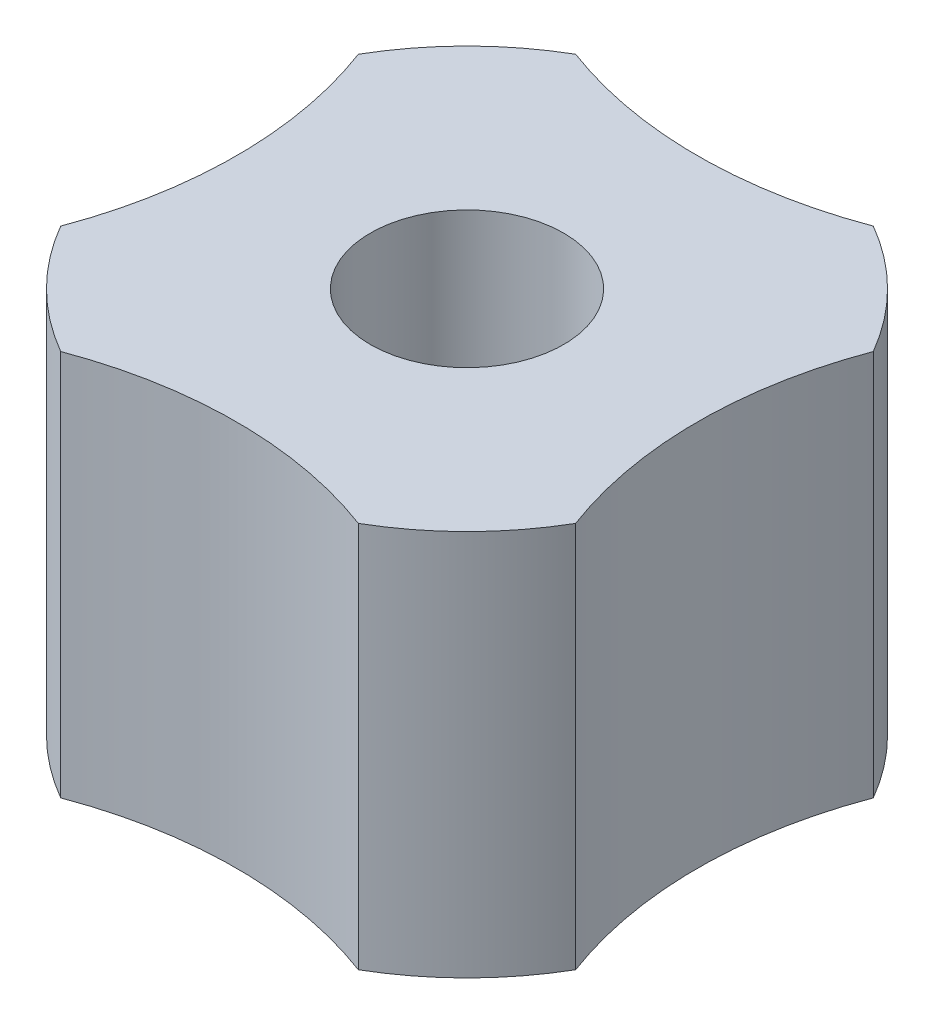
ISO-10303-21;
HEADER;
FILE_DESCRIPTION(('STEP AP214'),'2;1');
FILE_NAME('part.step','',(''),(''),'','','');
FILE_SCHEMA(('AUTOMOTIVE_DESIGN { 1 0 10303 214 1 1 1 1 }'));
ENDSEC;
DATA;
#1=APPLICATION_CONTEXT('core data for automotive mechanical design processes');
#2=APPLICATION_PROTOCOL_DEFINITION('international standard','automotive_design',2000,#1);
#3=PRODUCT_CONTEXT('',#1,'mechanical');
#4=PRODUCT('Part','Part','',(#3));
#5=PRODUCT_RELATED_PRODUCT_CATEGORY('part','',(#4));
#6=PRODUCT_DEFINITION_FORMATION('','',#4);
#7=PRODUCT_DEFINITION_CONTEXT('part definition',#1,'design');
#8=PRODUCT_DEFINITION('design','',#6,#7);
#9=PRODUCT_DEFINITION_SHAPE('','',#8);
#10=(LENGTH_UNIT() NAMED_UNIT(*) SI_UNIT(.MILLI.,.METRE.));
#11=(NAMED_UNIT(*) PLANE_ANGLE_UNIT() SI_UNIT($,.RADIAN.));
#12=(NAMED_UNIT(*) SI_UNIT($,.STERADIAN.) SOLID_ANGLE_UNIT());
#13=UNCERTAINTY_MEASURE_WITH_UNIT(LENGTH_MEASURE(1.E-05),#10,'distance_accuracy_value','');
#14=(GEOMETRIC_REPRESENTATION_CONTEXT(3) GLOBAL_UNCERTAINTY_ASSIGNED_CONTEXT((#13)) GLOBAL_UNIT_ASSIGNED_CONTEXT((#10,
#11,#12)) REPRESENTATION_CONTEXT('',''));
#15=CARTESIAN_POINT('',(0.,0.,0.));
#16=DIRECTION('',(0.,0.,1.));
#17=DIRECTION('',(1.,0.,0.));
#18=AXIS2_PLACEMENT_3D('',#15,#16,#17);
#19=CARTESIAN_POINT('',(2.5,27.,-3.25));
#20=DIRECTION('',(0.,1.,0.));
#21=DIRECTION('',(0.,0.,1.));
#22=AXIS2_PLACEMENT_3D('',#19,#20,#21);
#23=CYLINDRICAL_SURFACE('',#22,2.5);
#24=DIRECTION('',(0.,1.,0.));
#25=VECTOR('',#24,1.);
#26=CARTESIAN_POINT('',(2.5,27.,-5.75));
#27=LINE('',#26,#25);
#28=CARTESIAN_POINT('',(2.5,34.,-5.75));
#29=VERTEX_POINT('',#28);
#30=CARTESIAN_POINT('',(2.5,27.,-5.75));
#31=VERTEX_POINT('',#30);
#32=EDGE_CURVE('E138',#29,#31,#27,.F.);
#33=ORIENTED_EDGE('',*,*,#32,.T.);
#34=CARTESIAN_POINT('',(2.5,27.,-3.25));
#35=DIRECTION('',(0.,1.,0.));
#36=DIRECTION('',(0.,0.,1.));
#37=AXIS2_PLACEMENT_3D('',#34,#35,#36);
#38=CIRCLE('',#37,2.5);
#39=CARTESIAN_POINT('',(5.,27.,-3.25));
#40=VERTEX_POINT('',#39);
#41=EDGE_CURVE('E239',#31,#40,#38,.F.);
#42=ORIENTED_EDGE('',*,*,#41,.T.);
#43=DIRECTION('',(0.,1.,0.));
#44=VECTOR('',#43,1.);
#45=CARTESIAN_POINT('',(5.,27.,-3.25));
#46=LINE('',#45,#44);
#47=CARTESIAN_POINT('',(5.,34.,-3.25));
#48=VERTEX_POINT('',#47);
#49=EDGE_CURVE('E167',#40,#48,#46,.T.);
#50=ORIENTED_EDGE('',*,*,#49,.T.);
#51=CARTESIAN_POINT('',(2.5,34.,-3.25));
#52=DIRECTION('',(0.,1.,0.));
#53=DIRECTION('',(0.,0.,1.));
#54=AXIS2_PLACEMENT_3D('',#51,#52,#53);
#55=CIRCLE('',#54,2.5);
#56=EDGE_CURVE('E232',#29,#48,#55,.F.);
#57=ORIENTED_EDGE('',*,*,#56,.F.);
#58=EDGE_LOOP('',(#33,#42,#50,#57));
#59=FACE_BOUND('',#58,.T.);
#60=ADVANCED_FACE('F16',(#59),#23,.F.);
#61=CARTESIAN_POINT('',(5.,27.,5.75));
#62=DIRECTION('',(1.,0.,0.));
#63=DIRECTION('',(0.,0.,-1.));
#64=AXIS2_PLACEMENT_3D('',#61,#62,#63);
#65=PLANE('',#64);
#66=DIRECTION('',(0.,0.,1.));
#67=VECTOR('',#66,1.);
#68=CARTESIAN_POINT('',(5.,27.,0.));
#69=LINE('',#68,#67);
#70=CARTESIAN_POINT('',(5.,27.,3.25));
#71=VERTEX_POINT('',#70);
#72=EDGE_CURVE('E238',#40,#71,#69,.T.);
#73=ORIENTED_EDGE('',*,*,#72,.T.);
#74=DIRECTION('',(0.,1.,0.));
#75=VECTOR('',#74,1.);
#76=CARTESIAN_POINT('',(5.,27.,3.25));
#77=LINE('',#76,#75);
#78=CARTESIAN_POINT('',(5.,34.,3.25));
#79=VERTEX_POINT('',#78);
#80=EDGE_CURVE('E165',#71,#79,#77,.T.);
#81=ORIENTED_EDGE('',*,*,#80,.T.);
#82=DIRECTION('',(0.,0.,-1.));
#83=VECTOR('',#82,1.);
#84=CARTESIAN_POINT('',(5.,34.,0.));
#85=LINE('',#84,#83);
#86=EDGE_CURVE('E231',#48,#79,#85,.F.);
#87=ORIENTED_EDGE('',*,*,#86,.F.);
#88=ORIENTED_EDGE('',*,*,#49,.F.);
#89=EDGE_LOOP('',(#73,#81,#87,#88));
#90=FACE_BOUND('',#89,.T.);
#91=ADVANCED_FACE('F253',(#90),#65,.F.);
#92=CARTESIAN_POINT('',(2.5,27.,3.25));
#93=DIRECTION('',(0.,1.,0.));
#94=DIRECTION('',(0.,0.,1.));
#95=AXIS2_PLACEMENT_3D('',#92,#93,#94);
#96=CYLINDRICAL_SURFACE('',#95,2.5);
#97=ORIENTED_EDGE('',*,*,#80,.F.);
#98=CARTESIAN_POINT('',(2.5,27.,3.25));
#99=DIRECTION('',(0.,1.,0.));
#100=DIRECTION('',(0.,0.,1.));
#101=AXIS2_PLACEMENT_3D('',#98,#99,#100);
#102=CIRCLE('',#101,2.5);
#103=CARTESIAN_POINT('',(2.5,27.,5.75));
#104=VERTEX_POINT('',#103);
#105=EDGE_CURVE('E236',#71,#104,#102,.F.);
#106=ORIENTED_EDGE('',*,*,#105,.T.);
#107=DIRECTION('',(0.,1.,0.));
#108=VECTOR('',#107,1.);
#109=CARTESIAN_POINT('',(2.5,27.,5.75));
#110=LINE('',#109,#108);
#111=CARTESIAN_POINT('',(2.5,34.,5.75));
#112=VERTEX_POINT('',#111);
#113=EDGE_CURVE('E163',#104,#112,#110,.T.);
#114=ORIENTED_EDGE('',*,*,#113,.T.);
#115=CARTESIAN_POINT('',(2.5,34.,3.25));
#116=DIRECTION('',(0.,1.,0.));
#117=DIRECTION('',(0.,0.,1.));
#118=AXIS2_PLACEMENT_3D('',#115,#116,#117);
#119=CIRCLE('',#118,2.5);
#120=EDGE_CURVE('E228',#79,#112,#119,.F.);
#121=ORIENTED_EDGE('',*,*,#120,.F.);
#122=EDGE_LOOP('',(#97,#106,#114,#121));
#123=FACE_BOUND('',#122,.T.);
#124=ADVANCED_FACE('F257',(#123),#96,.F.);
#125=CARTESIAN_POINT('',(-5.,27.,5.75));
#126=DIRECTION('',(0.,0.,1.));
#127=DIRECTION('',(1.,0.,0.));
#128=AXIS2_PLACEMENT_3D('',#125,#126,#127);
#129=PLANE('',#128);
#130=DIRECTION('',(1.,0.,0.));
#131=VECTOR('',#130,1.);
#132=CARTESIAN_POINT('',(0.,34.,5.75));
#133=LINE('',#132,#131);
#134=CARTESIAN_POINT('',(-2.5,34.,5.75));
#135=VERTEX_POINT('',#134);
#136=EDGE_CURVE('E227',#112,#135,#133,.F.);
#137=ORIENTED_EDGE('',*,*,#136,.F.);
#138=ORIENTED_EDGE('',*,*,#113,.F.);
#139=DIRECTION('',(1.,0.,0.));
#140=VECTOR('',#139,1.);
#141=CARTESIAN_POINT('',(0.,27.,5.75));
#142=LINE('',#141,#140);
#143=CARTESIAN_POINT('',(-2.5,27.,5.75));
#144=VERTEX_POINT('',#143);
#145=EDGE_CURVE('E235',#104,#144,#142,.F.);
#146=ORIENTED_EDGE('',*,*,#145,.T.);
#147=DIRECTION('',(0.,1.,0.));
#148=VECTOR('',#147,1.);
#149=CARTESIAN_POINT('',(-2.5,27.,5.75));
#150=LINE('',#149,#148);
#151=EDGE_CURVE('E127',#144,#135,#150,.T.);
#152=ORIENTED_EDGE('',*,*,#151,.T.);
#153=EDGE_LOOP('',(#137,#138,#146,#152));
#154=FACE_BOUND('',#153,.T.);
#155=ADVANCED_FACE('F269',(#154),#129,.F.);
#156=CARTESIAN_POINT('',(-2.5,27.,3.25));
#157=DIRECTION('',(0.,1.,0.));
#158=DIRECTION('',(0.,0.,1.));
#159=AXIS2_PLACEMENT_3D('',#156,#157,#158);
#160=CYLINDRICAL_SURFACE('',#159,2.5);
#161=ORIENTED_EDGE('',*,*,#151,.F.);
#162=CARTESIAN_POINT('',(-2.5,27.,3.25));
#163=DIRECTION('',(0.,1.,0.));
#164=DIRECTION('',(0.,0.,1.));
#165=AXIS2_PLACEMENT_3D('',#162,#163,#164);
#166=CIRCLE('',#165,2.5);
#167=CARTESIAN_POINT('',(-5.,27.,3.25));
#168=VERTEX_POINT('',#167);
#169=EDGE_CURVE('E19',#144,#168,#166,.F.);
#170=ORIENTED_EDGE('',*,*,#169,.T.);
#171=DIRECTION('',(0.,1.,0.));
#172=VECTOR('',#171,1.);
#173=CARTESIAN_POINT('',(-5.,27.,3.25));
#174=LINE('',#173,#172);
#175=CARTESIAN_POINT('',(-5.,34.,3.25));
#176=VERTEX_POINT('',#175);
#177=EDGE_CURVE('E132',#168,#176,#174,.T.);
#178=ORIENTED_EDGE('',*,*,#177,.T.);
#179=CARTESIAN_POINT('',(-2.5,34.,3.25));
#180=DIRECTION('',(0.,1.,0.));
#181=DIRECTION('',(0.,0.,1.));
#182=AXIS2_PLACEMENT_3D('',#179,#180,#181);
#183=CIRCLE('',#182,2.5);
#184=EDGE_CURVE('E225',#135,#176,#183,.F.);
#185=ORIENTED_EDGE('',*,*,#184,.F.);
#186=EDGE_LOOP('',(#161,#170,#178,#185));
#187=FACE_BOUND('',#186,.T.);
#188=ADVANCED_FACE('F131',(#187),#160,.F.);
#189=CARTESIAN_POINT('',(-5.,27.,-5.75));
#190=DIRECTION('',(-1.,0.,0.));
#191=DIRECTION('',(0.,0.,1.));
#192=AXIS2_PLACEMENT_3D('',#189,#190,#191);
#193=PLANE('',#192);
#194=DIRECTION('',(0.,0.,-1.));
#195=VECTOR('',#194,1.);
#196=CARTESIAN_POINT('',(-5.,34.,0.));
#197=LINE('',#196,#195);
#198=CARTESIAN_POINT('',(-5.,34.,-3.25));
#199=VERTEX_POINT('',#198);
#200=EDGE_CURVE('E143',#176,#199,#197,.T.);
#201=ORIENTED_EDGE('',*,*,#200,.F.);
#202=ORIENTED_EDGE('',*,*,#177,.F.);
#203=DIRECTION('',(0.,0.,1.));
#204=VECTOR('',#203,1.);
#205=CARTESIAN_POINT('',(-5.,27.,0.));
#206=LINE('',#205,#204);
#207=CARTESIAN_POINT('',(-5.,27.,-3.25));
#208=VERTEX_POINT('',#207);
#209=EDGE_CURVE('E137',#168,#208,#206,.F.);
#210=ORIENTED_EDGE('',*,*,#209,.T.);
#211=DIRECTION('',(0.,1.,0.));
#212=VECTOR('',#211,1.);
#213=CARTESIAN_POINT('',(-5.,27.,-3.25));
#214=LINE('',#213,#212);
#215=EDGE_CURVE('E145',#208,#199,#214,.T.);
#216=ORIENTED_EDGE('',*,*,#215,.T.);
#217=EDGE_LOOP('',(#201,#202,#210,#216));
#218=FACE_BOUND('',#217,.T.);
#219=ADVANCED_FACE('F140',(#218),#193,.F.);
#220=CARTESIAN_POINT('',(-2.5,27.,-3.25));
#221=DIRECTION('',(0.,1.,0.));
#222=DIRECTION('',(0.,0.,1.));
#223=AXIS2_PLACEMENT_3D('',#220,#221,#222);
#224=CYLINDRICAL_SURFACE('',#223,2.5);
#225=ORIENTED_EDGE('',*,*,#215,.F.);
#226=CARTESIAN_POINT('',(-2.5,27.,-3.25));
#227=DIRECTION('',(0.,1.,0.));
#228=DIRECTION('',(0.,0.,1.));
#229=AXIS2_PLACEMENT_3D('',#226,#227,#228);
#230=CIRCLE('',#229,2.5);
#231=CARTESIAN_POINT('',(-2.5,27.,-5.75));
#232=VERTEX_POINT('',#231);
#233=EDGE_CURVE('E152',#208,#232,#230,.F.);
#234=ORIENTED_EDGE('',*,*,#233,.T.);
#235=DIRECTION('',(0.,1.,0.));
#236=VECTOR('',#235,1.);
#237=CARTESIAN_POINT('',(-2.5,27.,-5.75));
#238=LINE('',#237,#236);
#239=CARTESIAN_POINT('',(-2.5,34.,-5.75));
#240=VERTEX_POINT('',#239);
#241=EDGE_CURVE('E158',#232,#240,#238,.T.);
#242=ORIENTED_EDGE('',*,*,#241,.T.);
#243=CARTESIAN_POINT('',(-2.5,34.,-3.25));
#244=DIRECTION('',(0.,1.,0.));
#245=DIRECTION('',(0.,0.,1.));
#246=AXIS2_PLACEMENT_3D('',#243,#244,#245);
#247=CIRCLE('',#246,2.5);
#248=EDGE_CURVE('E222',#199,#240,#247,.F.);
#249=ORIENTED_EDGE('',*,*,#248,.F.);
#250=EDGE_LOOP('',(#225,#234,#242,#249));
#251=FACE_BOUND('',#250,.T.);
#252=ADVANCED_FACE('F348',(#251),#224,.F.);
#253=CARTESIAN_POINT('',(5.,27.,-5.75));
#254=DIRECTION('',(0.,0.,-1.));
#255=DIRECTION('',(-1.,0.,0.));
#256=AXIS2_PLACEMENT_3D('',#253,#254,#255);
#257=PLANE('',#256);
#258=DIRECTION('',(1.,0.,0.));
#259=VECTOR('',#258,1.);
#260=CARTESIAN_POINT('',(0.,34.,-5.75));
#261=LINE('',#260,#259);
#262=EDGE_CURVE('E221',#240,#29,#261,.T.);
#263=ORIENTED_EDGE('',*,*,#262,.F.);
#264=ORIENTED_EDGE('',*,*,#241,.F.);
#265=DIRECTION('',(1.,0.,0.));
#266=VECTOR('',#265,1.);
#267=CARTESIAN_POINT('',(0.,27.,-5.75));
#268=LINE('',#267,#266);
#269=EDGE_CURVE('E154',#232,#31,#268,.T.);
#270=ORIENTED_EDGE('',*,*,#269,.T.);
#271=ORIENTED_EDGE('',*,*,#32,.F.);
#272=EDGE_LOOP('',(#263,#264,#270,#271));
#273=FACE_BOUND('',#272,.T.);
#274=ADVANCED_FACE('F248',(#273),#257,.F.);
#275=CARTESIAN_POINT('',(0.,27.,0.));
#276=DIRECTION('',(0.,1.,0.));
#277=DIRECTION('',(0.,0.,1.));
#278=AXIS2_PLACEMENT_3D('',#275,#276,#277);
#279=PLANE('',#278);
#280=ORIENTED_EDGE('',*,*,#105,.F.);
#281=ORIENTED_EDGE('',*,*,#72,.F.);
#282=ORIENTED_EDGE('',*,*,#41,.F.);
#283=ORIENTED_EDGE('',*,*,#269,.F.);
#284=ORIENTED_EDGE('',*,*,#233,.F.);
#285=ORIENTED_EDGE('',*,*,#209,.F.);
#286=ORIENTED_EDGE('',*,*,#169,.F.);
#287=ORIENTED_EDGE('',*,*,#145,.F.);
#288=EDGE_LOOP('',(#280,#281,#282,#283,#284,#285,#286,#287));
#289=FACE_BOUND('',#288,.T.);
#290=CARTESIAN_POINT('',(0.,27.,-22.));
#291=DIRECTION('',(0.,-1.,0.));
#292=DIRECTION('',(0.,0.,-1.));
#293=AXIS2_PLACEMENT_3D('',#290,#291,#292);
#294=CIRCLE('',#293,14.25);
#295=CARTESIAN_POINT('',(-5.00447222996498,27.,-8.65767045454545));
#296=VERTEX_POINT('',#295);
#297=CARTESIAN_POINT('',(5.00447222996498,27.,-8.65767045454545));
#298=VERTEX_POINT('',#297);
#299=EDGE_CURVE('E195',#296,#298,#294,.F.);
#300=ORIENTED_EDGE('',*,*,#299,.T.);
#301=CARTESIAN_POINT('',(0.,27.,0.));
#302=DIRECTION('',(0.,-1.,0.));
#303=DIRECTION('',(0.,0.,-1.));
#304=AXIS2_PLACEMENT_3D('',#301,#302,#303);
#305=CIRCLE('',#304,10.);
#306=CARTESIAN_POINT('',(8.65767045454546,27.,-5.00447222996498));
#307=VERTEX_POINT('',#306);
#308=EDGE_CURVE('E198',#307,#298,#305,.F.);
#309=ORIENTED_EDGE('',*,*,#308,.F.);
#310=CARTESIAN_POINT('',(22.,27.,0.));
#311=DIRECTION('',(0.,-1.,0.));
#312=DIRECTION('',(0.,0.,-1.));
#313=AXIS2_PLACEMENT_3D('',#310,#311,#312);
#314=CIRCLE('',#313,14.25);
#315=CARTESIAN_POINT('',(8.65767045454545,27.,5.00447222996499));
#316=VERTEX_POINT('',#315);
#317=EDGE_CURVE('E201',#307,#316,#314,.F.);
#318=ORIENTED_EDGE('',*,*,#317,.T.);
#319=CARTESIAN_POINT('',(0.,27.,0.));
#320=DIRECTION('',(0.,-1.,0.));
#321=DIRECTION('',(0.,0.,-1.));
#322=AXIS2_PLACEMENT_3D('',#319,#320,#321);
#323=CIRCLE('',#322,10.);
#324=CARTESIAN_POINT('',(5.00447222996498,27.,8.65767045454546));
#325=VERTEX_POINT('',#324);
#326=EDGE_CURVE('E204',#325,#316,#323,.F.);
#327=ORIENTED_EDGE('',*,*,#326,.F.);
#328=CARTESIAN_POINT('',(0.,27.,22.));
#329=DIRECTION('',(0.,-1.,0.));
#330=DIRECTION('',(0.,0.,-1.));
#331=AXIS2_PLACEMENT_3D('',#328,#329,#330);
#332=CIRCLE('',#331,14.25);
#333=CARTESIAN_POINT('',(-5.00447222996498,27.,8.65767045454545));
#334=VERTEX_POINT('',#333);
#335=EDGE_CURVE('E208',#325,#334,#332,.F.);
#336=ORIENTED_EDGE('',*,*,#335,.T.);
#337=CARTESIAN_POINT('',(0.,27.,0.));
#338=DIRECTION('',(0.,-1.,0.));
#339=DIRECTION('',(0.,0.,-1.));
#340=AXIS2_PLACEMENT_3D('',#337,#338,#339);
#341=CIRCLE('',#340,10.);
#342=CARTESIAN_POINT('',(-8.65767045454545,27.,5.00447222996499));
#343=VERTEX_POINT('',#342);
#344=EDGE_CURVE('E211',#343,#334,#341,.F.);
#345=ORIENTED_EDGE('',*,*,#344,.F.);
#346=CARTESIAN_POINT('',(-22.,27.,0.));
#347=DIRECTION('',(0.,-1.,0.));
#348=DIRECTION('',(0.,0.,-1.));
#349=AXIS2_PLACEMENT_3D('',#346,#347,#348);
#350=CIRCLE('',#349,14.25);
#351=CARTESIAN_POINT('',(-8.65767045454545,27.,-5.00447222996498));
#352=VERTEX_POINT('',#351);
#353=EDGE_CURVE('E215',#343,#352,#350,.F.);
#354=ORIENTED_EDGE('',*,*,#353,.T.);
#355=CARTESIAN_POINT('',(0.,27.,0.));
#356=DIRECTION('',(0.,-1.,0.));
#357=DIRECTION('',(0.,0.,-1.));
#358=AXIS2_PLACEMENT_3D('',#355,#356,#357);
#359=CIRCLE('',#358,10.);
#360=EDGE_CURVE('E218',#296,#352,#359,.F.);
#361=ORIENTED_EDGE('',*,*,#360,.F.);
#362=EDGE_LOOP('',(#300,#309,#318,#327,#336,#345,#354,#361));
#363=FACE_BOUND('',#362,.T.);
#364=ADVANCED_FACE('F149',(#289,#363),#279,.F.);
#365=CARTESIAN_POINT('',(0.,34.,0.));
#366=DIRECTION('',(0.,-1.,0.));
#367=DIRECTION('',(0.,0.,-1.));
#368=AXIS2_PLACEMENT_3D('',#365,#366,#367);
#369=PLANE('',#368);
#370=CARTESIAN_POINT('',(0.,34.,0.));
#371=DIRECTION('',(0.,-1.,0.));
#372=DIRECTION('',(0.,0.,-1.));
#373=AXIS2_PLACEMENT_3D('',#370,#371,#372);
#374=CIRCLE('',#373,3.25);
#375=CARTESIAN_POINT('',(0.,34.,-3.25));
#376=VERTEX_POINT('',#375);
#377=EDGE_CURVE('E192',#376,#376,#374,.F.);
#378=ORIENTED_EDGE('',*,*,#377,.T.);
#379=EDGE_LOOP('',(#378));
#380=FACE_BOUND('',#379,.T.);
#381=ORIENTED_EDGE('',*,*,#248,.T.);
#382=ORIENTED_EDGE('',*,*,#262,.T.);
#383=ORIENTED_EDGE('',*,*,#56,.T.);
#384=ORIENTED_EDGE('',*,*,#86,.T.);
#385=ORIENTED_EDGE('',*,*,#120,.T.);
#386=ORIENTED_EDGE('',*,*,#136,.T.);
#387=ORIENTED_EDGE('',*,*,#184,.T.);
#388=ORIENTED_EDGE('',*,*,#200,.T.);
#389=EDGE_LOOP('',(#381,#382,#383,#384,#385,#386,#387,#388));
#390=FACE_BOUND('',#389,.T.);
#391=ADVANCED_FACE('F263',(#380,#390),#369,.T.);
#392=CARTESIAN_POINT('',(0.,40.,0.));
#393=DIRECTION('',(0.,-1.,0.));
#394=DIRECTION('',(0.,0.,-1.));
#395=AXIS2_PLACEMENT_3D('',#392,#393,#394);
#396=CYLINDRICAL_SURFACE('',#395,10.);
#397=ORIENTED_EDGE('',*,*,#360,.T.);
#398=DIRECTION('',(0.,-1.,0.));
#399=VECTOR('',#398,1.);
#400=CARTESIAN_POINT('',(-8.65767045454545,40.,-5.00447222996498));
#401=LINE('',#400,#399);
#402=CARTESIAN_POINT('',(-8.65767045454545,40.,-5.00447222996498));
#403=VERTEX_POINT('',#402);
#404=EDGE_CURVE('E217',#352,#403,#401,.F.);
#405=ORIENTED_EDGE('',*,*,#404,.T.);
#406=CARTESIAN_POINT('',(0.,40.,0.));
#407=DIRECTION('',(0.,-1.,0.));
#408=DIRECTION('',(0.,0.,-1.));
#409=AXIS2_PLACEMENT_3D('',#406,#407,#408);
#410=CIRCLE('',#409,10.);
#411=CARTESIAN_POINT('',(-5.00447222996498,40.,-8.65767045454545));
#412=VERTEX_POINT('',#411);
#413=EDGE_CURVE('E189',#412,#403,#410,.F.);
#414=ORIENTED_EDGE('',*,*,#413,.F.);
#415=DIRECTION('',(0.,-1.,0.));
#416=VECTOR('',#415,1.);
#417=CARTESIAN_POINT('',(-5.00447222996498,40.,-8.65767045454545));
#418=LINE('',#417,#416);
#419=EDGE_CURVE('E197',#412,#296,#418,.T.);
#420=ORIENTED_EDGE('',*,*,#419,.T.);
#421=EDGE_LOOP('',(#397,#405,#414,#420));
#422=FACE_BOUND('',#421,.T.);
#423=ADVANCED_FACE('F287',(#422),#396,.T.);
#424=CARTESIAN_POINT('',(-22.,40.,0.));
#425=DIRECTION('',(0.,-1.,0.));
#426=DIRECTION('',(0.,0.,-1.));
#427=AXIS2_PLACEMENT_3D('',#424,#425,#426);
#428=CYLINDRICAL_SURFACE('',#427,14.25);
#429=ORIENTED_EDGE('',*,*,#404,.F.);
#430=ORIENTED_EDGE('',*,*,#353,.F.);
#431=DIRECTION('',(0.,-1.,0.));
#432=VECTOR('',#431,1.);
#433=CARTESIAN_POINT('',(-8.65767045454545,40.,5.00447222996499));
#434=LINE('',#433,#432);
#435=CARTESIAN_POINT('',(-8.65767045454545,40.,5.00447222996499));
#436=VERTEX_POINT('',#435);
#437=EDGE_CURVE('E214',#436,#343,#434,.T.);
#438=ORIENTED_EDGE('',*,*,#437,.F.);
#439=CARTESIAN_POINT('',(-22.,40.,0.));
#440=DIRECTION('',(0.,-1.,0.));
#441=DIRECTION('',(0.,0.,-1.));
#442=AXIS2_PLACEMENT_3D('',#439,#440,#441);
#443=CIRCLE('',#442,14.25);
#444=EDGE_CURVE('E186',#403,#436,#443,.T.);
#445=ORIENTED_EDGE('',*,*,#444,.F.);
#446=EDGE_LOOP('',(#429,#430,#438,#445));
#447=FACE_BOUND('',#446,.T.);
#448=ADVANCED_FACE('F311',(#447),#428,.F.);
#449=CARTESIAN_POINT('',(0.,40.,0.));
#450=DIRECTION('',(0.,-1.,0.));
#451=DIRECTION('',(0.,0.,-1.));
#452=AXIS2_PLACEMENT_3D('',#449,#450,#451);
#453=CYLINDRICAL_SURFACE('',#452,10.);
#454=ORIENTED_EDGE('',*,*,#344,.T.);
#455=DIRECTION('',(0.,-1.,0.));
#456=VECTOR('',#455,1.);
#457=CARTESIAN_POINT('',(-5.00447222996498,40.,8.65767045454545));
#458=LINE('',#457,#456);
#459=CARTESIAN_POINT('',(-5.00447222996498,40.,8.65767045454545));
#460=VERTEX_POINT('',#459);
#461=EDGE_CURVE('E210',#334,#460,#458,.F.);
#462=ORIENTED_EDGE('',*,*,#461,.T.);
#463=CARTESIAN_POINT('',(0.,40.,0.));
#464=DIRECTION('',(0.,-1.,0.));
#465=DIRECTION('',(0.,0.,-1.));
#466=AXIS2_PLACEMENT_3D('',#463,#464,#465);
#467=CIRCLE('',#466,10.);
#468=EDGE_CURVE('E183',#436,#460,#467,.F.);
#469=ORIENTED_EDGE('',*,*,#468,.F.);
#470=ORIENTED_EDGE('',*,*,#437,.T.);
#471=EDGE_LOOP('',(#454,#462,#469,#470));
#472=FACE_BOUND('',#471,.T.);
#473=ADVANCED_FACE('F307',(#472),#453,.T.);
#474=CARTESIAN_POINT('',(0.,40.,22.));
#475=DIRECTION('',(0.,-1.,0.));
#476=DIRECTION('',(0.,0.,-1.));
#477=AXIS2_PLACEMENT_3D('',#474,#475,#476);
#478=CYLINDRICAL_SURFACE('',#477,14.25);
#479=ORIENTED_EDGE('',*,*,#461,.F.);
#480=ORIENTED_EDGE('',*,*,#335,.F.);
#481=DIRECTION('',(0.,-1.,0.));
#482=VECTOR('',#481,1.);
#483=CARTESIAN_POINT('',(5.00447222996498,40.,8.65767045454546));
#484=LINE('',#483,#482);
#485=CARTESIAN_POINT('',(5.00447222996498,40.,8.65767045454546));
#486=VERTEX_POINT('',#485);
#487=EDGE_CURVE('E207',#486,#325,#484,.T.);
#488=ORIENTED_EDGE('',*,*,#487,.F.);
#489=CARTESIAN_POINT('',(0.,40.,22.));
#490=DIRECTION('',(0.,-1.,0.));
#491=DIRECTION('',(0.,0.,-1.));
#492=AXIS2_PLACEMENT_3D('',#489,#490,#491);
#493=CIRCLE('',#492,14.25);
#494=EDGE_CURVE('E180',#460,#486,#493,.T.);
#495=ORIENTED_EDGE('',*,*,#494,.F.);
#496=EDGE_LOOP('',(#479,#480,#488,#495));
#497=FACE_BOUND('',#496,.T.);
#498=ADVANCED_FACE('F304',(#497),#478,.F.);
#499=CARTESIAN_POINT('',(0.,40.,0.));
#500=DIRECTION('',(0.,-1.,0.));
#501=DIRECTION('',(0.,0.,-1.));
#502=AXIS2_PLACEMENT_3D('',#499,#500,#501);
#503=CYLINDRICAL_SURFACE('',#502,10.);
#504=ORIENTED_EDGE('',*,*,#326,.T.);
#505=DIRECTION('',(0.,-1.,0.));
#506=VECTOR('',#505,1.);
#507=CARTESIAN_POINT('',(8.65767045454546,40.,5.00447222996499));
#508=LINE('',#507,#506);
#509=CARTESIAN_POINT('',(8.65767045454545,40.,5.00447222996499));
#510=VERTEX_POINT('',#509);
#511=EDGE_CURVE('E203',#316,#510,#508,.F.);
#512=ORIENTED_EDGE('',*,*,#511,.T.);
#513=CARTESIAN_POINT('',(0.,40.,0.));
#514=DIRECTION('',(0.,-1.,0.));
#515=DIRECTION('',(0.,0.,-1.));
#516=AXIS2_PLACEMENT_3D('',#513,#514,#515);
#517=CIRCLE('',#516,10.);
#518=EDGE_CURVE('E177',#486,#510,#517,.F.);
#519=ORIENTED_EDGE('',*,*,#518,.F.);
#520=ORIENTED_EDGE('',*,*,#487,.T.);
#521=EDGE_LOOP('',(#504,#512,#519,#520));
#522=FACE_BOUND('',#521,.T.);
#523=ADVANCED_FACE('F299',(#522),#503,.T.);
#524=CARTESIAN_POINT('',(22.,40.,0.));
#525=DIRECTION('',(0.,-1.,0.));
#526=DIRECTION('',(0.,0.,-1.));
#527=AXIS2_PLACEMENT_3D('',#524,#525,#526);
#528=CYLINDRICAL_SURFACE('',#527,14.25);
#529=ORIENTED_EDGE('',*,*,#511,.F.);
#530=ORIENTED_EDGE('',*,*,#317,.F.);
#531=DIRECTION('',(0.,-1.,0.));
#532=VECTOR('',#531,1.);
#533=CARTESIAN_POINT('',(8.65767045454546,40.,-5.00447222996498));
#534=LINE('',#533,#532);
#535=CARTESIAN_POINT('',(8.65767045454546,40.,-5.00447222996498));
#536=VERTEX_POINT('',#535);
#537=EDGE_CURVE('E200',#536,#307,#534,.T.);
#538=ORIENTED_EDGE('',*,*,#537,.F.);
#539=CARTESIAN_POINT('',(22.,40.,0.));
#540=DIRECTION('',(0.,-1.,0.));
#541=DIRECTION('',(0.,0.,-1.));
#542=AXIS2_PLACEMENT_3D('',#539,#540,#541);
#543=CIRCLE('',#542,14.25);
#544=EDGE_CURVE('E174',#510,#536,#543,.T.);
#545=ORIENTED_EDGE('',*,*,#544,.F.);
#546=EDGE_LOOP('',(#529,#530,#538,#545));
#547=FACE_BOUND('',#546,.T.);
#548=ADVANCED_FACE('F296',(#547),#528,.F.);
#549=CARTESIAN_POINT('',(0.,40.,0.));
#550=DIRECTION('',(0.,-1.,0.));
#551=DIRECTION('',(0.,0.,-1.));
#552=AXIS2_PLACEMENT_3D('',#549,#550,#551);
#553=CYLINDRICAL_SURFACE('',#552,10.);
#554=ORIENTED_EDGE('',*,*,#308,.T.);
#555=DIRECTION('',(0.,-1.,0.));
#556=VECTOR('',#555,1.);
#557=CARTESIAN_POINT('',(5.00447222996498,40.,-8.65767045454545));
#558=LINE('',#557,#556);
#559=CARTESIAN_POINT('',(5.00447222996498,40.,-8.65767045454545));
#560=VERTEX_POINT('',#559);
#561=EDGE_CURVE('E34',#298,#560,#558,.F.);
#562=ORIENTED_EDGE('',*,*,#561,.T.);
#563=CARTESIAN_POINT('',(0.,40.,0.));
#564=DIRECTION('',(0.,-1.,0.));
#565=DIRECTION('',(0.,0.,-1.));
#566=AXIS2_PLACEMENT_3D('',#563,#564,#565);
#567=CIRCLE('',#566,10.);
#568=EDGE_CURVE('E171',#536,#560,#567,.F.);
#569=ORIENTED_EDGE('',*,*,#568,.F.);
#570=ORIENTED_EDGE('',*,*,#537,.T.);
#571=EDGE_LOOP('',(#554,#562,#569,#570));
#572=FACE_BOUND('',#571,.T.);
#573=ADVANCED_FACE('F292',(#572),#553,.T.);
#574=CARTESIAN_POINT('',(0.,40.,-22.));
#575=DIRECTION('',(0.,-1.,0.));
#576=DIRECTION('',(0.,0.,-1.));
#577=AXIS2_PLACEMENT_3D('',#574,#575,#576);
#578=CYLINDRICAL_SURFACE('',#577,14.25);
#579=ORIENTED_EDGE('',*,*,#561,.F.);
#580=ORIENTED_EDGE('',*,*,#299,.F.);
#581=ORIENTED_EDGE('',*,*,#419,.F.);
#582=CARTESIAN_POINT('',(0.,40.,-22.));
#583=DIRECTION('',(0.,-1.,0.));
#584=DIRECTION('',(0.,0.,-1.));
#585=AXIS2_PLACEMENT_3D('',#582,#583,#584);
#586=CIRCLE('',#585,14.25);
#587=EDGE_CURVE('E25',#560,#412,#586,.T.);
#588=ORIENTED_EDGE('',*,*,#587,.F.);
#589=EDGE_LOOP('',(#579,#580,#581,#588));
#590=FACE_BOUND('',#589,.T.);
#591=ADVANCED_FACE('F290',(#590),#578,.F.);
#592=CARTESIAN_POINT('',(0.,40.,0.));
#593=DIRECTION('',(0.,-1.,0.));
#594=DIRECTION('',(0.,0.,-1.));
#595=AXIS2_PLACEMENT_3D('',#592,#593,#594);
#596=CYLINDRICAL_SURFACE('',#595,3.25);
#597=CARTESIAN_POINT('',(0.,40.,0.));
#598=DIRECTION('',(0.,-1.,0.));
#599=DIRECTION('',(0.,0.,-1.));
#600=AXIS2_PLACEMENT_3D('',#597,#598,#599);
#601=CIRCLE('',#600,3.25);
#602=CARTESIAN_POINT('',(0.,40.,-3.25));
#603=VERTEX_POINT('',#602);
#604=EDGE_CURVE('E11',#603,#603,#601,.T.);
#605=ORIENTED_EDGE('',*,*,#604,.F.);
#606=EDGE_LOOP('',(#605));
#607=FACE_BOUND('',#606,.T.);
#608=ORIENTED_EDGE('',*,*,#377,.F.);
#609=EDGE_LOOP('',(#608));
#610=FACE_BOUND('',#609,.T.);
#611=ADVANCED_FACE('F315',(#607,#610),#596,.F.);
#612=CARTESIAN_POINT('',(0.,40.,0.));
#613=DIRECTION('',(0.,1.,0.));
#614=DIRECTION('',(0.,0.,1.));
#615=AXIS2_PLACEMENT_3D('',#612,#613,#614);
#616=PLANE('',#615);
#617=ORIENTED_EDGE('',*,*,#604,.T.);
#618=EDGE_LOOP('',(#617));
#619=FACE_BOUND('',#618,.T.);
#620=ORIENTED_EDGE('',*,*,#568,.T.);
#621=ORIENTED_EDGE('',*,*,#587,.T.);
#622=ORIENTED_EDGE('',*,*,#413,.T.);
#623=ORIENTED_EDGE('',*,*,#444,.T.);
#624=ORIENTED_EDGE('',*,*,#468,.T.);
#625=ORIENTED_EDGE('',*,*,#494,.T.);
#626=ORIENTED_EDGE('',*,*,#518,.T.);
#627=ORIENTED_EDGE('',*,*,#544,.T.);
#628=EDGE_LOOP('',(#620,#621,#622,#623,#624,#625,#626,#627));
#629=FACE_BOUND('',#628,.T.);
#630=ADVANCED_FACE('F313',(#619,#629),#616,.T.);
#631=CLOSED_SHELL('',(#60,#91,#124,#155,#188,#219,#252,#274,#364,#391,#423,#448,#473,#498,#523,
#548,#573,#591,#611,#630));
#632=MANIFOLD_SOLID_BREP('B1',#631);
#633=ADVANCED_BREP_SHAPE_REPRESENTATION('',(#18,#632),#14);
#634=SHAPE_DEFINITION_REPRESENTATION(#9,#633);
ENDSEC;
END-ISO-10303-21;
